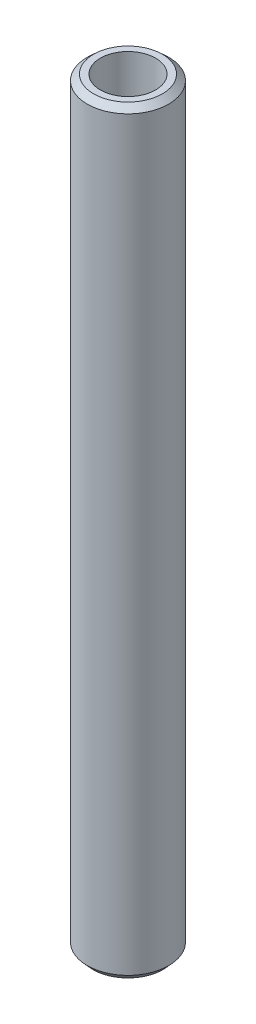
ISO-10303-21;
HEADER;
FILE_DESCRIPTION(('STEP AP214'),'2;1');
FILE_NAME('part.step','',(''),(''),'','','');
FILE_SCHEMA(('AUTOMOTIVE_DESIGN { 1 0 10303 214 1 1 1 1 }'));
ENDSEC;
DATA;
#1=APPLICATION_CONTEXT('core data for automotive mechanical design processes');
#2=APPLICATION_PROTOCOL_DEFINITION('international standard','automotive_design',2000,#1);
#3=PRODUCT_CONTEXT('',#1,'mechanical');
#4=PRODUCT('Part','Part','',(#3));
#5=PRODUCT_RELATED_PRODUCT_CATEGORY('part','',(#4));
#6=PRODUCT_DEFINITION_FORMATION('','',#4);
#7=PRODUCT_DEFINITION_CONTEXT('part definition',#1,'design');
#8=PRODUCT_DEFINITION('design','',#6,#7);
#9=PRODUCT_DEFINITION_SHAPE('','',#8);
#10=(LENGTH_UNIT() NAMED_UNIT(*) SI_UNIT(.MILLI.,.METRE.));
#11=(NAMED_UNIT(*) PLANE_ANGLE_UNIT() SI_UNIT($,.RADIAN.));
#12=(NAMED_UNIT(*) SI_UNIT($,.STERADIAN.) SOLID_ANGLE_UNIT());
#13=UNCERTAINTY_MEASURE_WITH_UNIT(LENGTH_MEASURE(1.E-05),#10,'distance_accuracy_value','');
#14=(GEOMETRIC_REPRESENTATION_CONTEXT(3) GLOBAL_UNCERTAINTY_ASSIGNED_CONTEXT((#13)) GLOBAL_UNIT_ASSIGNED_CONTEXT((#10,
#11,#12)) REPRESENTATION_CONTEXT('',''));
#15=CARTESIAN_POINT('',(0.,0.,0.));
#16=DIRECTION('',(0.,0.,1.));
#17=DIRECTION('',(1.,0.,0.));
#18=AXIS2_PLACEMENT_3D('',#15,#16,#17);
#19=CARTESIAN_POINT('',(0.,279.537881715817,0.));
#20=DIRECTION('',(0.,-1.,0.));
#21=DIRECTION('',(0.,0.,-1.));
#22=AXIS2_PLACEMENT_3D('',#19,#20,#21);
#23=CYLINDRICAL_SURFACE('',#22,15.);
#24=CARTESIAN_POINT('',(0.,277.425769487222,0.));
#25=DIRECTION('',(0.,1.,0.));
#26=DIRECTION('',(0.,0.,1.));
#27=AXIS2_PLACEMENT_3D('',#24,#25,#26);
#28=CIRCLE('',#27,15.);
#29=CARTESIAN_POINT('',(0.,277.425769487222,15.));
#30=VERTEX_POINT('',#29);
#31=EDGE_CURVE('E50',#30,#30,#28,.F.);
#32=ORIENTED_EDGE('',*,*,#31,.T.);
#33=EDGE_LOOP('',(#32));
#34=FACE_BOUND('',#33,.T.);
#35=CARTESIAN_POINT('',(0.,2.33459811615883,0.));
#36=DIRECTION('',(0.,1.,0.));
#37=DIRECTION('',(0.,0.,1.));
#38=AXIS2_PLACEMENT_3D('',#35,#36,#37);
#39=CIRCLE('',#38,15.);
#40=CARTESIAN_POINT('',(0.,2.33459811615883,15.));
#41=VERTEX_POINT('',#40);
#42=EDGE_CURVE('E51',#41,#41,#39,.T.);
#43=ORIENTED_EDGE('',*,*,#42,.T.);
#44=EDGE_LOOP('',(#43));
#45=FACE_BOUND('',#44,.T.);
#46=ADVANCED_FACE('F39',(#34,#45),#23,.T.);
#47=CARTESIAN_POINT('',(0.,279.537881715817,0.));
#48=DIRECTION('',(0.,1.,0.));
#49=DIRECTION('',(0.,0.,1.));
#50=AXIS2_PLACEMENT_3D('',#47,#48,#49);
#51=PLANE('',#50);
#52=CARTESIAN_POINT('',(0.,279.537881715817,0.));
#53=DIRECTION('',(0.,1.,0.));
#54=DIRECTION('',(0.,0.,1.));
#55=AXIS2_PLACEMENT_3D('',#52,#53,#54);
#56=CIRCLE('',#55,12.6654018838412);
#57=CARTESIAN_POINT('',(0.,279.537881715817,12.6654018838412));
#58=VERTEX_POINT('',#57);
#59=EDGE_CURVE('E54',#58,#58,#56,.T.);
#60=ORIENTED_EDGE('',*,*,#59,.T.);
#61=EDGE_LOOP('',(#60));
#62=FACE_BOUND('',#61,.T.);
#63=CARTESIAN_POINT('',(0.,279.537881715817,0.));
#64=DIRECTION('',(0.,1.,0.));
#65=DIRECTION('',(0.,0.,1.));
#66=AXIS2_PLACEMENT_3D('',#63,#64,#65);
#67=CIRCLE('',#66,10.1850540474921);
#68=CARTESIAN_POINT('',(0.,279.537881715817,10.1850540474921));
#69=VERTEX_POINT('',#68);
#70=EDGE_CURVE('E58',#69,#69,#67,.T.);
#71=ORIENTED_EDGE('',*,*,#70,.F.);
#72=EDGE_LOOP('',(#71));
#73=FACE_BOUND('',#72,.T.);
#74=ADVANCED_FACE('F69',(#62,#73),#51,.T.);
#75=CARTESIAN_POINT('',(0.,0.,0.));
#76=DIRECTION('',(0.,1.,0.));
#77=DIRECTION('',(0.,0.,1.));
#78=AXIS2_PLACEMENT_3D('',#75,#76,#77);
#79=PLANE('',#78);
#80=CARTESIAN_POINT('',(0.,0.,0.));
#81=DIRECTION('',(0.,1.,0.));
#82=DIRECTION('',(0.,0.,1.));
#83=AXIS2_PLACEMENT_3D('',#80,#81,#82);
#84=CIRCLE('',#83,12.8878877714045);
#85=CARTESIAN_POINT('',(0.,0.,12.8878877714045));
#86=VERTEX_POINT('',#85);
#87=EDGE_CURVE('E10',#86,#86,#84,.F.);
#88=ORIENTED_EDGE('',*,*,#87,.T.);
#89=EDGE_LOOP('',(#88));
#90=FACE_BOUND('',#89,.T.);
#91=CARTESIAN_POINT('',(0.,0.,0.));
#92=DIRECTION('',(0.,1.,0.));
#93=DIRECTION('',(0.,0.,1.));
#94=AXIS2_PLACEMENT_3D('',#91,#92,#93);
#95=CIRCLE('',#94,10.1850540474921);
#96=CARTESIAN_POINT('',(0.,0.,10.1850540474921));
#97=VERTEX_POINT('',#96);
#98=EDGE_CURVE('E63',#97,#97,#95,.T.);
#99=ORIENTED_EDGE('',*,*,#98,.T.);
#100=EDGE_LOOP('',(#99));
#101=FACE_BOUND('',#100,.T.);
#102=ADVANCED_FACE('F75',(#90,#101),#79,.F.);
#103=CARTESIAN_POINT('',(0.,279.537881715817,0.));
#104=DIRECTION('',(0.,-1.,0.));
#105=DIRECTION('',(0.,0.,-1.));
#106=AXIS2_PLACEMENT_3D('',#103,#104,#105);
#107=CYLINDRICAL_SURFACE('',#106,10.1850540474921);
#108=ORIENTED_EDGE('',*,*,#70,.T.);
#109=EDGE_LOOP('',(#108));
#110=FACE_BOUND('',#109,.T.);
#111=ORIENTED_EDGE('',*,*,#98,.F.);
#112=EDGE_LOOP('',(#111));
#113=FACE_BOUND('',#112,.T.);
#114=ADVANCED_FACE('F70',(#110,#113),#107,.F.);
#115=CARTESIAN_POINT('',(0.,279.537881715817,0.));
#116=DIRECTION('',(0.,-1.,0.));
#117=DIRECTION('',(0.,0.,-1.));
#118=AXIS2_PLACEMENT_3D('',#115,#116,#117);
#119=CONICAL_SURFACE('',#118,12.6654018838412,0.835390290816016);
#120=ORIENTED_EDGE('',*,*,#31,.F.);
#121=EDGE_LOOP('',(#120));
#122=FACE_BOUND('',#121,.T.);
#123=ORIENTED_EDGE('',*,*,#59,.F.);
#124=EDGE_LOOP('',(#123));
#125=FACE_BOUND('',#124,.T.);
#126=ADVANCED_FACE('F81',(#122,#125),#119,.T.);
#127=CARTESIAN_POINT('',(0.,2.33459811615883,0.));
#128=DIRECTION('',(0.,1.,0.));
#129=DIRECTION('',(0.,0.,1.));
#130=AXIS2_PLACEMENT_3D('',#127,#128,#129);
#131=CONICAL_SURFACE('',#130,15.,0.735406035978894);
#132=CARTESIAN_POINT('',(0.,0.,12.8878877714045));
#133=CARTESIAN_POINT('',(0.,0.0243187303766543,12.9098889404524));
#134=CARTESIAN_POINT('',(0.,0.0486374607533087,12.9318901095003));
#135=CARTESIAN_POINT('',(0.,0.0972749215066174,12.975892447596));
#136=CARTESIAN_POINT('',(0.,0.121593651883272,12.9978936166439));
#137=CARTESIAN_POINT('',(0.,0.170231112636581,13.0418959547396));
#138=CARTESIAN_POINT('',(0.,0.194549843013235,13.0638971237875));
#139=CARTESIAN_POINT('',(0.,0.243187303766544,13.1078994618832));
#140=CARTESIAN_POINT('',(0.,0.267506034143198,13.1299006309311));
#141=CARTESIAN_POINT('',(0.,0.316143494896507,13.1739029690268));
#142=CARTESIAN_POINT('',(0.,0.340462225273162,13.1959041380747));
#143=CARTESIAN_POINT('',(0.,0.389099686026471,13.2399064761704));
#144=CARTESIAN_POINT('',(0.,0.413418416403125,13.2619076452183));
#145=CARTESIAN_POINT('',(0.,0.462055877156434,13.3059099833141));
#146=CARTESIAN_POINT('',(0.,0.486374607533088,13.3279111523619));
#147=CARTESIAN_POINT('',(0.,0.535012068286397,13.3719134904577));
#148=CARTESIAN_POINT('',(0.,0.559330798663051,13.3939146595055));
#149=CARTESIAN_POINT('',(0.,0.60796825941636,13.4379169976013));
#150=CARTESIAN_POINT('',(0.,0.632286989793015,13.4599181666491));
#151=CARTESIAN_POINT('',(0.,0.680924450546324,13.5039205047449));
#152=CARTESIAN_POINT('',(0.,0.705243180922978,13.5259216737927));
#153=CARTESIAN_POINT('',(0.,0.753880641676287,13.5699240118885));
#154=CARTESIAN_POINT('',(0.,0.778199372052941,13.5919251809364));
#155=CARTESIAN_POINT('',(0.,0.82683683280625,13.6359275190321));
#156=CARTESIAN_POINT('',(0.,0.851155563182905,13.65792868808));
#157=CARTESIAN_POINT('',(0.,0.899793023936214,13.7019310261757));
#158=CARTESIAN_POINT('',(0.,0.924111754312868,13.7239321952236));
#159=CARTESIAN_POINT('',(0.,0.972749215066177,13.7679345333193));
#160=CARTESIAN_POINT('',(0.,0.997067945442832,13.7899357023672));
#161=CARTESIAN_POINT('',(0.,1.04570540619614,13.8339380404629));
#162=CARTESIAN_POINT('',(0.,1.07002413657279,13.8559392095108));
#163=CARTESIAN_POINT('',(0.,1.1186615973261,13.8999415476065));
#164=CARTESIAN_POINT('',(0.,1.14298032770276,13.9219427166544));
#165=CARTESIAN_POINT('',(0.,1.19161778845607,13.9659450547501));
#166=CARTESIAN_POINT('',(0.,1.21593651883272,13.987946223798));
#167=CARTESIAN_POINT('',(0.,1.26457397958603,14.0319485618937));
#168=CARTESIAN_POINT('',(0.,1.28889270996268,14.0539497309416));
#169=CARTESIAN_POINT('',(0.,1.33753017071599,14.0979520690374));
#170=CARTESIAN_POINT('',(0.,1.36184890109265,14.1199532380852));
#171=CARTESIAN_POINT('',(0.,1.41048636184596,14.163955576181));
#172=CARTESIAN_POINT('',(0.,1.43480509222261,14.1859567452288));
#173=CARTESIAN_POINT('',(0.,1.48344255297592,14.2299590833246));
#174=CARTESIAN_POINT('',(0.,1.50776128335257,14.2519602523724));
#175=CARTESIAN_POINT('',(0.,1.55639874410588,14.2959625904682));
#176=CARTESIAN_POINT('',(0.,1.58071747448254,14.317963759516));
#177=CARTESIAN_POINT('',(0.,1.62935493523585,14.3619660976118));
#178=CARTESIAN_POINT('',(0.,1.6536736656125,14.3839672666597));
#179=CARTESIAN_POINT('',(0.,1.70231112636581,14.4279696047554));
#180=CARTESIAN_POINT('',(0.,1.72662985674246,14.4499707738033));
#181=CARTESIAN_POINT('',(0.,1.77526731749577,14.493973111899));
#182=CARTESIAN_POINT('',(0.,1.79958604787243,14.5159742809469));
#183=CARTESIAN_POINT('',(0.,1.84822350862574,14.5599766190426));
#184=CARTESIAN_POINT('',(0.,1.87254223900239,14.5819777880905));
#185=CARTESIAN_POINT('',(0.,1.9211796997557,14.6259801261862));
#186=CARTESIAN_POINT('',(0.,1.94549843013235,14.6479812952341));
#187=CARTESIAN_POINT('',(0.,1.99413589088566,14.6919836333298));
#188=CARTESIAN_POINT('',(0.,2.01845462126232,14.7139848023777));
#189=CARTESIAN_POINT('',(0.,2.06709208201563,14.7579871404734));
#190=CARTESIAN_POINT('',(0.,2.09141081239228,14.7799883095213));
#191=CARTESIAN_POINT('',(0.,2.14004827314559,14.823990647617));
#192=CARTESIAN_POINT('',(0.,2.16436700352224,14.8459918166649));
#193=CARTESIAN_POINT('',(0.,2.21300446427555,14.8899941547607));
#194=CARTESIAN_POINT('',(0.,2.23732319465221,14.9119953238085));
#195=CARTESIAN_POINT('',(0.,2.28596065540552,14.9559976619043));
#196=CARTESIAN_POINT('',(0.,2.31027938578217,14.9779988309521));
#197=CARTESIAN_POINT('',(0.,2.33459811615883,15.));
#198=B_SPLINE_CURVE_WITH_KNOTS('',3,(#132,#133,#134,#135,#136,#137,#138,#139,#140,#141,#142,
#143,#144,#145,#146,#147,#148,#149,#150,#151,#152,#153,#154,#155,#156,#157,#158,#159,#160,#161,
#162,#163,#164,#165,#166,#167,#168,#169,#170,#171,#172,#173,#174,#175,#176,#177,#178,#179,#180,
#181,#182,#183,#184,#185,#186,#187,#188,#189,#190,#191,#192,#193,#194,#195,#196,#197),
.UNSPECIFIED.,.F.,.F.,(4,2,2,2,2,2,2,2,2,2,2,2,2,2,2,2,2,2,2,2,2,2,2,2,2,2,2,2,2,2,2,2,4),(0.,
0.0983822584587684,0.196764516917538,0.295146775376307,0.393529033835077,0.491911292293845,
0.590293550752615,0.688675809211384,0.787058067670154,0.885440326128922,0.983822584587692,
1.08220484304646,1.18058710150523,1.278969359964,1.37735161842277,1.47573387688154,
1.57411613534031,1.67249839379908,1.77088065225785,1.86926291071662,1.96764516917539,
2.06602742763415,2.16440968609292,2.26279194455169,2.36117420301046,2.45955646146923,
2.557938719928,2.65632097838677,2.75470323684554,2.85308549530431,2.95146775376308,
3.04985001222185,3.14823227068061),.UNSPECIFIED.);
#199=EDGE_CURVE('BSEAM45',#86,#41,#198,.T.);
#200=ORIENTED_EDGE('',*,*,#87,.F.);
#201=ORIENTED_EDGE('',*,*,#42,.F.);
#202=ORIENTED_EDGE('',*,*,#199,.T.);
#203=ORIENTED_EDGE('',*,*,#199,.F.);
#204=EDGE_LOOP('',(#200,#202,#201,#203));
#205=FACE_BOUND('',#204,.T.);
#206=ADVANCED_FACE('F45',(#205),#131,.T.);
#207=CLOSED_SHELL('',(#46,#74,#102,#114,#126,#206));
#208=MANIFOLD_SOLID_BREP('B2',#207);
#209=ADVANCED_BREP_SHAPE_REPRESENTATION('',(#18,#208),#14);
#210=SHAPE_DEFINITION_REPRESENTATION(#9,#209);
ENDSEC;
END-ISO-10303-21;
